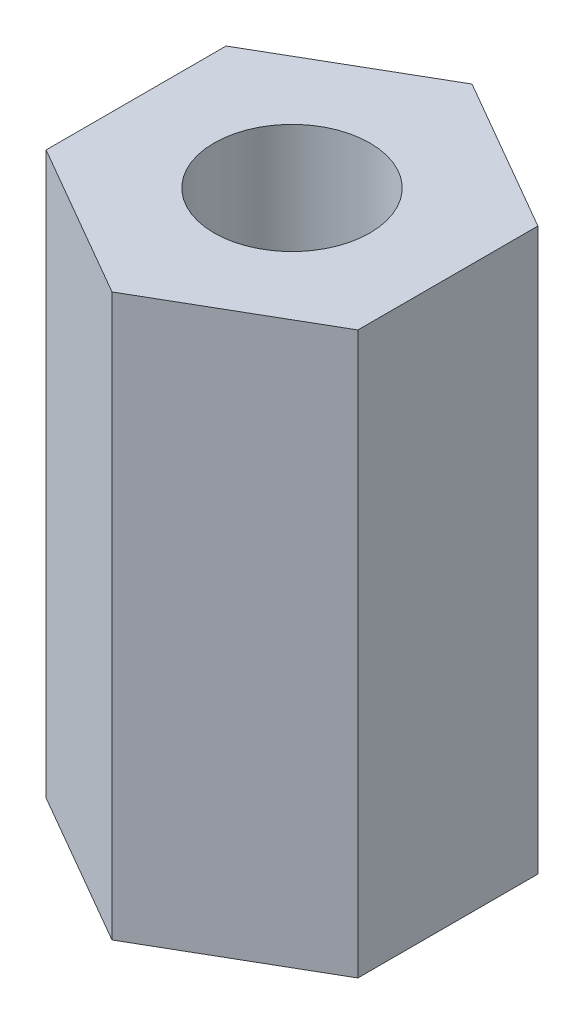
ISO-10303-21;
HEADER;
FILE_DESCRIPTION(('STEP AP214'),'2;1');
FILE_NAME('part.step','',(''),(''),'','','');
FILE_SCHEMA(('AUTOMOTIVE_DESIGN { 1 0 10303 214 1 1 1 1 }'));
ENDSEC;
DATA;
#1=APPLICATION_CONTEXT('core data for automotive mechanical design processes');
#2=APPLICATION_PROTOCOL_DEFINITION('international standard','automotive_design',2000,#1);
#3=PRODUCT_CONTEXT('',#1,'mechanical');
#4=PRODUCT('Part','Part','',(#3));
#5=PRODUCT_RELATED_PRODUCT_CATEGORY('part','',(#4));
#6=PRODUCT_DEFINITION_FORMATION('','',#4);
#7=PRODUCT_DEFINITION_CONTEXT('part definition',#1,'design');
#8=PRODUCT_DEFINITION('design','',#6,#7);
#9=PRODUCT_DEFINITION_SHAPE('','',#8);
#10=(LENGTH_UNIT() NAMED_UNIT(*) SI_UNIT(.MILLI.,.METRE.));
#11=(NAMED_UNIT(*) PLANE_ANGLE_UNIT() SI_UNIT($,.RADIAN.));
#12=(NAMED_UNIT(*) SI_UNIT($,.STERADIAN.) SOLID_ANGLE_UNIT());
#13=UNCERTAINTY_MEASURE_WITH_UNIT(LENGTH_MEASURE(1.E-05),#10,'distance_accuracy_value','');
#14=(GEOMETRIC_REPRESENTATION_CONTEXT(3) GLOBAL_UNCERTAINTY_ASSIGNED_CONTEXT((#13)) GLOBAL_UNIT_ASSIGNED_CONTEXT((#10,
#11,#12)) REPRESENTATION_CONTEXT('',''));
#15=CARTESIAN_POINT('',(0.,0.,0.));
#16=DIRECTION('',(0.,0.,1.));
#17=DIRECTION('',(1.,0.,0.));
#18=AXIS2_PLACEMENT_3D('',#15,#16,#17);
#19=CARTESIAN_POINT('',(0.,9.,2.88675134594813));
#20=DIRECTION('',(-0.5,0.,-0.866025403784439));
#21=DIRECTION('',(-0.866025403784439,0.,0.5));
#22=AXIS2_PLACEMENT_3D('',#19,#20,#21);
#23=PLANE('',#22);
#24=DIRECTION('',(0.866025403784439,0.,-0.5));
#25=VECTOR('',#24,1.);
#26=CARTESIAN_POINT('',(0.,0.,2.88675134594813));
#27=LINE('',#26,#25);
#28=CARTESIAN_POINT('',(0.,0.,2.88675134594813));
#29=VERTEX_POINT('',#28);
#30=CARTESIAN_POINT('',(2.5,0.,1.44337567297407));
#31=VERTEX_POINT('',#30);
#32=EDGE_CURVE('E117',#29,#31,#27,.T.);
#33=ORIENTED_EDGE('',*,*,#32,.T.);
#34=DIRECTION('',(0.,-1.,0.));
#35=VECTOR('',#34,1.);
#36=CARTESIAN_POINT('',(2.5,9.,1.44337567297407));
#37=LINE('',#36,#35);
#38=CARTESIAN_POINT('',(2.5,9.,1.44337567297407));
#39=VERTEX_POINT('',#38);
#40=EDGE_CURVE('E11',#39,#31,#37,.T.);
#41=ORIENTED_EDGE('',*,*,#40,.F.);
#42=DIRECTION('',(0.866025403784439,0.,-0.5));
#43=VECTOR('',#42,1.);
#44=CARTESIAN_POINT('',(0.,9.,2.88675134594813));
#45=LINE('',#44,#43);
#46=CARTESIAN_POINT('',(0.,9.,2.88675134594813));
#47=VERTEX_POINT('',#46);
#48=EDGE_CURVE('E128',#47,#39,#45,.T.);
#49=ORIENTED_EDGE('',*,*,#48,.F.);
#50=DIRECTION('',(0.,-1.,0.));
#51=VECTOR('',#50,1.);
#52=CARTESIAN_POINT('',(0.,9.,2.88675134594813));
#53=LINE('',#52,#51);
#54=EDGE_CURVE('E113',#47,#29,#53,.T.);
#55=ORIENTED_EDGE('',*,*,#54,.T.);
#56=EDGE_LOOP('',(#33,#41,#49,#55));
#57=FACE_BOUND('',#56,.T.);
#58=ADVANCED_FACE('F33',(#57),#23,.F.);
#59=CARTESIAN_POINT('',(2.5,9.,1.44337567297407));
#60=DIRECTION('',(-1.,0.,0.));
#61=DIRECTION('',(0.,0.,1.));
#62=AXIS2_PLACEMENT_3D('',#59,#60,#61);
#63=PLANE('',#62);
#64=DIRECTION('',(0.,0.,-1.));
#65=VECTOR('',#64,1.);
#66=CARTESIAN_POINT('',(2.5,0.,1.44337567297407));
#67=LINE('',#66,#65);
#68=CARTESIAN_POINT('',(2.5,0.,-1.44337567297407));
#69=VERTEX_POINT('',#68);
#70=EDGE_CURVE('E120',#31,#69,#67,.T.);
#71=ORIENTED_EDGE('',*,*,#70,.T.);
#72=DIRECTION('',(0.,-1.,0.));
#73=VECTOR('',#72,1.);
#74=CARTESIAN_POINT('',(2.5,9.,-1.44337567297407));
#75=LINE('',#74,#73);
#76=CARTESIAN_POINT('',(2.5,9.,-1.44337567297407));
#77=VERTEX_POINT('',#76);
#78=EDGE_CURVE('E41',#77,#69,#75,.T.);
#79=ORIENTED_EDGE('',*,*,#78,.F.);
#80=DIRECTION('',(0.,0.,-1.));
#81=VECTOR('',#80,1.);
#82=CARTESIAN_POINT('',(2.5,9.,1.44337567297407));
#83=LINE('',#82,#81);
#84=EDGE_CURVE('E86',#39,#77,#83,.T.);
#85=ORIENTED_EDGE('',*,*,#84,.F.);
#86=ORIENTED_EDGE('',*,*,#40,.T.);
#87=EDGE_LOOP('',(#71,#79,#85,#86));
#88=FACE_BOUND('',#87,.T.);
#89=ADVANCED_FACE('F154',(#88),#63,.F.);
#90=CARTESIAN_POINT('',(2.5,9.,-1.44337567297407));
#91=DIRECTION('',(-0.5,0.,0.866025403784439));
#92=DIRECTION('',(0.866025403784439,0.,0.5));
#93=AXIS2_PLACEMENT_3D('',#90,#91,#92);
#94=PLANE('',#93);
#95=DIRECTION('',(-0.866025403784438,0.,-0.5));
#96=VECTOR('',#95,1.);
#97=CARTESIAN_POINT('',(2.5,0.,-1.44337567297407));
#98=LINE('',#97,#96);
#99=CARTESIAN_POINT('',(0.,0.,-2.88675134594813));
#100=VERTEX_POINT('',#99);
#101=EDGE_CURVE('E123',#69,#100,#98,.T.);
#102=ORIENTED_EDGE('',*,*,#101,.T.);
#103=DIRECTION('',(0.,-1.,0.));
#104=VECTOR('',#103,1.);
#105=CARTESIAN_POINT('',(0.,9.,-2.88675134594813));
#106=LINE('',#105,#104);
#107=CARTESIAN_POINT('',(0.,9.,-2.88675134594813));
#108=VERTEX_POINT('',#107);
#109=EDGE_CURVE('E108',#108,#100,#106,.T.);
#110=ORIENTED_EDGE('',*,*,#109,.F.);
#111=DIRECTION('',(-0.866025403784438,0.,-0.5));
#112=VECTOR('',#111,1.);
#113=CARTESIAN_POINT('',(2.5,9.,-1.44337567297407));
#114=LINE('',#113,#112);
#115=EDGE_CURVE('E99',#77,#108,#114,.T.);
#116=ORIENTED_EDGE('',*,*,#115,.F.);
#117=ORIENTED_EDGE('',*,*,#78,.T.);
#118=EDGE_LOOP('',(#102,#110,#116,#117));
#119=FACE_BOUND('',#118,.T.);
#120=ADVANCED_FACE('F134',(#119),#94,.F.);
#121=CARTESIAN_POINT('',(0.,9.,-2.88675134594813));
#122=DIRECTION('',(0.5,0.,0.866025403784439));
#123=DIRECTION('',(0.866025403784439,0.,-0.5));
#124=AXIS2_PLACEMENT_3D('',#121,#122,#123);
#125=PLANE('',#124);
#126=DIRECTION('',(-0.866025403784439,0.,0.5));
#127=VECTOR('',#126,1.);
#128=CARTESIAN_POINT('',(0.,0.,-2.88675134594813));
#129=LINE('',#128,#127);
#130=CARTESIAN_POINT('',(-2.5,0.,-1.44337567297407));
#131=VERTEX_POINT('',#130);
#132=EDGE_CURVE('E107',#100,#131,#129,.T.);
#133=ORIENTED_EDGE('',*,*,#132,.T.);
#134=DIRECTION('',(0.,-1.,0.));
#135=VECTOR('',#134,1.);
#136=CARTESIAN_POINT('',(-2.5,9.,-1.44337567297407));
#137=LINE('',#136,#135);
#138=CARTESIAN_POINT('',(-2.5,9.,-1.44337567297407));
#139=VERTEX_POINT('',#138);
#140=EDGE_CURVE('E104',#139,#131,#137,.T.);
#141=ORIENTED_EDGE('',*,*,#140,.F.);
#142=DIRECTION('',(-0.866025403784439,0.,0.5));
#143=VECTOR('',#142,1.);
#144=CARTESIAN_POINT('',(0.,9.,-2.88675134594813));
#145=LINE('',#144,#143);
#146=EDGE_CURVE('E93',#108,#139,#145,.T.);
#147=ORIENTED_EDGE('',*,*,#146,.F.);
#148=ORIENTED_EDGE('',*,*,#109,.T.);
#149=EDGE_LOOP('',(#133,#141,#147,#148));
#150=FACE_BOUND('',#149,.T.);
#151=ADVANCED_FACE('F105',(#150),#125,.F.);
#152=CARTESIAN_POINT('',(-2.5,9.,-1.44337567297407));
#153=DIRECTION('',(1.,0.,0.));
#154=DIRECTION('',(0.,0.,-1.));
#155=AXIS2_PLACEMENT_3D('',#152,#153,#154);
#156=PLANE('',#155);
#157=DIRECTION('',(0.,0.,1.));
#158=VECTOR('',#157,1.);
#159=CARTESIAN_POINT('',(-2.5,0.,-1.44337567297407));
#160=LINE('',#159,#158);
#161=CARTESIAN_POINT('',(-2.5,0.,1.44337567297406));
#162=VERTEX_POINT('',#161);
#163=EDGE_CURVE('E72',#131,#162,#160,.T.);
#164=ORIENTED_EDGE('',*,*,#163,.T.);
#165=DIRECTION('',(0.,-1.,0.));
#166=VECTOR('',#165,1.);
#167=CARTESIAN_POINT('',(-2.5,9.,1.44337567297406));
#168=LINE('',#167,#166);
#169=CARTESIAN_POINT('',(-2.5,9.,1.44337567297406));
#170=VERTEX_POINT('',#169);
#171=EDGE_CURVE('E109',#170,#162,#168,.T.);
#172=ORIENTED_EDGE('',*,*,#171,.F.);
#173=DIRECTION('',(0.,0.,1.));
#174=VECTOR('',#173,1.);
#175=CARTESIAN_POINT('',(-2.5,9.,-1.44337567297407));
#176=LINE('',#175,#174);
#177=EDGE_CURVE('E97',#139,#170,#176,.T.);
#178=ORIENTED_EDGE('',*,*,#177,.F.);
#179=ORIENTED_EDGE('',*,*,#140,.T.);
#180=EDGE_LOOP('',(#164,#172,#178,#179));
#181=FACE_BOUND('',#180,.T.);
#182=ADVANCED_FACE('F111',(#181),#156,.F.);
#183=CARTESIAN_POINT('',(-2.5,9.,1.44337567297406));
#184=DIRECTION('',(0.500000000000001,0.,-0.866025403784438));
#185=DIRECTION('',(-0.866025403784438,0.,-0.500000000000001));
#186=AXIS2_PLACEMENT_3D('',#183,#184,#185);
#187=PLANE('',#186);
#188=DIRECTION('',(0.866025403784438,0.,0.500000000000001));
#189=VECTOR('',#188,1.);
#190=CARTESIAN_POINT('',(-2.5,0.,1.44337567297406));
#191=LINE('',#190,#189);
#192=EDGE_CURVE('E78',#162,#29,#191,.T.);
#193=ORIENTED_EDGE('',*,*,#192,.T.);
#194=ORIENTED_EDGE('',*,*,#54,.F.);
#195=DIRECTION('',(0.866025403784438,0.,0.500000000000001));
#196=VECTOR('',#195,1.);
#197=CARTESIAN_POINT('',(-2.5,9.,1.44337567297406));
#198=LINE('',#197,#196);
#199=EDGE_CURVE('E49',#170,#47,#198,.T.);
#200=ORIENTED_EDGE('',*,*,#199,.F.);
#201=ORIENTED_EDGE('',*,*,#171,.T.);
#202=EDGE_LOOP('',(#193,#194,#200,#201));
#203=FACE_BOUND('',#202,.T.);
#204=ADVANCED_FACE('F141',(#203),#187,.F.);
#205=CARTESIAN_POINT('',(0.,9.,0.));
#206=DIRECTION('',(0.,1.,0.));
#207=DIRECTION('',(0.,0.,1.));
#208=AXIS2_PLACEMENT_3D('',#205,#206,#207);
#209=PLANE('',#208);
#210=CARTESIAN_POINT('',(0.,9.,0.));
#211=DIRECTION('',(0.,1.,0.));
#212=DIRECTION('',(0.,0.,1.));
#213=AXIS2_PLACEMENT_3D('',#210,#211,#212);
#214=CIRCLE('',#213,1.24999999999999);
#215=CARTESIAN_POINT('',(0.,9.,1.24999999999999));
#216=VERTEX_POINT('',#215);
#217=EDGE_CURVE('E208',#216,#216,#214,.T.);
#218=ORIENTED_EDGE('',*,*,#217,.F.);
#219=EDGE_LOOP('',(#218));
#220=FACE_BOUND('',#219,.T.);
#221=ORIENTED_EDGE('',*,*,#48,.T.);
#222=ORIENTED_EDGE('',*,*,#84,.T.);
#223=ORIENTED_EDGE('',*,*,#115,.T.);
#224=ORIENTED_EDGE('',*,*,#146,.T.);
#225=ORIENTED_EDGE('',*,*,#177,.T.);
#226=ORIENTED_EDGE('',*,*,#199,.T.);
#227=EDGE_LOOP('',(#221,#222,#223,#224,#225,#226));
#228=FACE_BOUND('',#227,.T.);
#229=ADVANCED_FACE('F95',(#220,#228),#209,.T.);
#230=CARTESIAN_POINT('',(0.,0.,0.));
#231=DIRECTION('',(0.,1.,0.));
#232=DIRECTION('',(0.,0.,1.));
#233=AXIS2_PLACEMENT_3D('',#230,#231,#232);
#234=PLANE('',#233);
#235=CARTESIAN_POINT('',(0.,0.,0.));
#236=DIRECTION('',(0.,1.,0.));
#237=DIRECTION('',(0.,0.,1.));
#238=AXIS2_PLACEMENT_3D('',#235,#236,#237);
#239=CIRCLE('',#238,1.25);
#240=CARTESIAN_POINT('',(0.,0.,1.25));
#241=VERTEX_POINT('',#240);
#242=EDGE_CURVE('E121',#241,#241,#239,.T.);
#243=ORIENTED_EDGE('',*,*,#242,.T.);
#244=EDGE_LOOP('',(#243));
#245=FACE_BOUND('',#244,.T.);
#246=ORIENTED_EDGE('',*,*,#32,.F.);
#247=ORIENTED_EDGE('',*,*,#192,.F.);
#248=ORIENTED_EDGE('',*,*,#163,.F.);
#249=ORIENTED_EDGE('',*,*,#132,.F.);
#250=ORIENTED_EDGE('',*,*,#101,.F.);
#251=ORIENTED_EDGE('',*,*,#70,.F.);
#252=EDGE_LOOP('',(#246,#247,#248,#249,#250,#251));
#253=FACE_BOUND('',#252,.T.);
#254=ADVANCED_FACE('F137',(#245,#253),#234,.F.);
#255=CARTESIAN_POINT('',(0.,9.,0.));
#256=DIRECTION('',(0.,1.,0.));
#257=DIRECTION('',(0.,0.,1.));
#258=AXIS2_PLACEMENT_3D('',#255,#256,#257);
#259=CYLINDRICAL_SURFACE('',#258,1.24999999999999);
#260=ORIENTED_EDGE('',*,*,#242,.F.);
#261=EDGE_LOOP('',(#260));
#262=FACE_BOUND('',#261,.T.);
#263=ORIENTED_EDGE('',*,*,#217,.T.);
#264=EDGE_LOOP('',(#263));
#265=FACE_BOUND('',#264,.T.);
#266=ADVANCED_FACE('F187',(#262,#265),#259,.F.);
#267=CLOSED_SHELL('',(#58,#89,#120,#151,#182,#204,#229,#254,#266));
#268=MANIFOLD_SOLID_BREP('B2',#267);
#269=ADVANCED_BREP_SHAPE_REPRESENTATION('',(#18,#268),#14);
#270=SHAPE_DEFINITION_REPRESENTATION(#9,#269);
ENDSEC;
END-ISO-10303-21;
